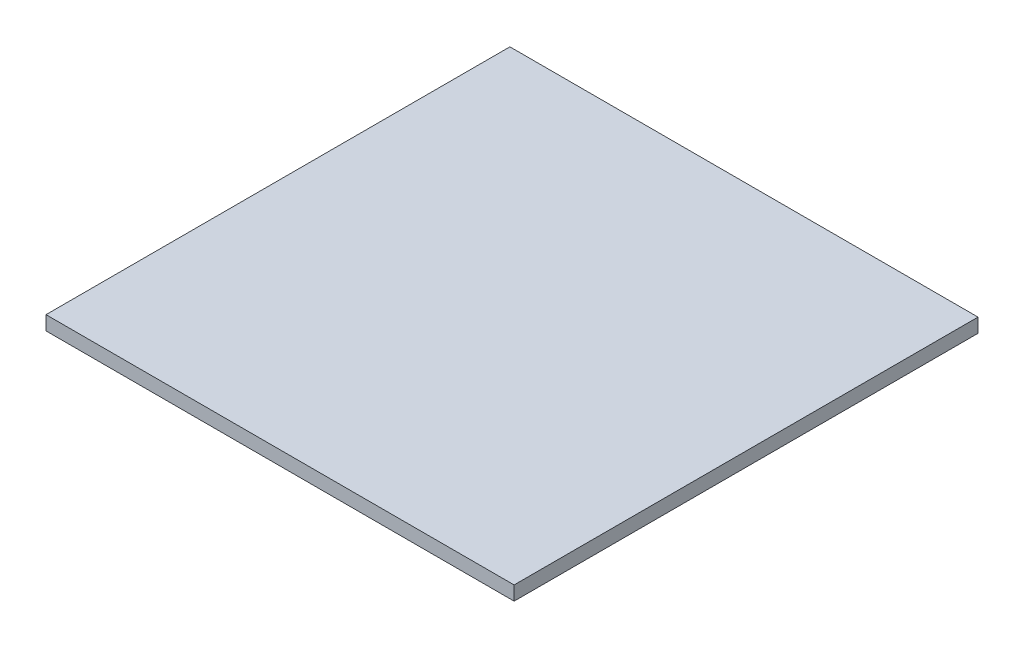
ISO-10303-21;
HEADER;
FILE_DESCRIPTION(('STEP AP214'),'2;1');
FILE_NAME('part.step','',(''),(''),'','','');
FILE_SCHEMA(('AUTOMOTIVE_DESIGN { 1 0 10303 214 1 1 1 1 }'));
ENDSEC;
DATA;
#1=APPLICATION_CONTEXT('core data for automotive mechanical design processes');
#2=APPLICATION_PROTOCOL_DEFINITION('international standard','automotive_design',2000,#1);
#3=PRODUCT_CONTEXT('',#1,'mechanical');
#4=PRODUCT('Part','Part','',(#3));
#5=PRODUCT_RELATED_PRODUCT_CATEGORY('part','',(#4));
#6=PRODUCT_DEFINITION_FORMATION('','',#4);
#7=PRODUCT_DEFINITION_CONTEXT('part definition',#1,'design');
#8=PRODUCT_DEFINITION('design','',#6,#7);
#9=PRODUCT_DEFINITION_SHAPE('','',#8);
#10=(LENGTH_UNIT() NAMED_UNIT(*) SI_UNIT(.MILLI.,.METRE.));
#11=(NAMED_UNIT(*) PLANE_ANGLE_UNIT() SI_UNIT($,.RADIAN.));
#12=(NAMED_UNIT(*) SI_UNIT($,.STERADIAN.) SOLID_ANGLE_UNIT());
#13=UNCERTAINTY_MEASURE_WITH_UNIT(LENGTH_MEASURE(1.E-05),#10,'distance_accuracy_value','');
#14=(GEOMETRIC_REPRESENTATION_CONTEXT(3) GLOBAL_UNCERTAINTY_ASSIGNED_CONTEXT((#13)) GLOBAL_UNIT_ASSIGNED_CONTEXT((#10,
#11,#12)) REPRESENTATION_CONTEXT('',''));
#15=CARTESIAN_POINT('',(0.,0.,0.));
#16=DIRECTION('',(0.,0.,1.));
#17=DIRECTION('',(1.,0.,0.));
#18=AXIS2_PLACEMENT_3D('',#15,#16,#17);
#19=CARTESIAN_POINT('',(-44.2815420560747,3.,-20.6980140186916));
#20=DIRECTION('',(1.,0.,0.));
#21=DIRECTION('',(0.,0.,-1.));
#22=AXIS2_PLACEMENT_3D('',#19,#20,#21);
#23=PLANE('',#22);
#24=DIRECTION('',(0.,0.,1.));
#25=VECTOR('',#24,1.);
#26=CARTESIAN_POINT('',(-44.2815420560747,0.,-20.6980140186916));
#27=LINE('',#26,#25);
#28=CARTESIAN_POINT('',(-44.2815420560747,0.,-20.6980140186916));
#29=VERTEX_POINT('',#28);
#30=CARTESIAN_POINT('',(-44.2815420560747,0.,78.1019859813084));
#31=VERTEX_POINT('',#30);
#32=EDGE_CURVE('E96',#29,#31,#27,.T.);
#33=ORIENTED_EDGE('',*,*,#32,.T.);
#34=DIRECTION('',(0.,-1.,0.));
#35=VECTOR('',#34,1.);
#36=CARTESIAN_POINT('',(-44.2815420560747,3.,78.1019859813084));
#37=LINE('',#36,#35);
#38=CARTESIAN_POINT('',(-44.2815420560747,3.,78.1019859813084));
#39=VERTEX_POINT('',#38);
#40=EDGE_CURVE('E11',#39,#31,#37,.T.);
#41=ORIENTED_EDGE('',*,*,#40,.F.);
#42=DIRECTION('',(0.,0.,1.));
#43=VECTOR('',#42,1.);
#44=CARTESIAN_POINT('',(-44.2815420560747,3.,-20.6980140186916));
#45=LINE('',#44,#43);
#46=CARTESIAN_POINT('',(-44.2815420560747,3.,-20.6980140186916));
#47=VERTEX_POINT('',#46);
#48=EDGE_CURVE('E84',#47,#39,#45,.T.);
#49=ORIENTED_EDGE('',*,*,#48,.F.);
#50=DIRECTION('',(0.,-1.,0.));
#51=VECTOR('',#50,1.);
#52=CARTESIAN_POINT('',(-44.2815420560747,3.,-20.6980140186916));
#53=LINE('',#52,#51);
#54=EDGE_CURVE('E92',#47,#29,#53,.T.);
#55=ORIENTED_EDGE('',*,*,#54,.T.);
#56=EDGE_LOOP('',(#33,#41,#49,#55));
#57=FACE_BOUND('',#56,.T.);
#58=ADVANCED_FACE('F33',(#57),#23,.F.);
#59=CARTESIAN_POINT('',(-44.2815420560747,3.,78.1019859813084));
#60=DIRECTION('',(0.,0.,-1.));
#61=DIRECTION('',(-1.,0.,0.));
#62=AXIS2_PLACEMENT_3D('',#59,#60,#61);
#63=PLANE('',#62);
#64=DIRECTION('',(1.,0.,0.));
#65=VECTOR('',#64,1.);
#66=CARTESIAN_POINT('',(-44.2815420560747,0.,78.1019859813084));
#67=LINE('',#66,#65);
#68=CARTESIAN_POINT('',(55.4184579439253,0.,78.1019859813084));
#69=VERTEX_POINT('',#68);
#70=EDGE_CURVE('E88',#31,#69,#67,.T.);
#71=ORIENTED_EDGE('',*,*,#70,.T.);
#72=DIRECTION('',(0.,-1.,0.));
#73=VECTOR('',#72,1.);
#74=CARTESIAN_POINT('',(55.4184579439253,3.,78.1019859813084));
#75=LINE('',#74,#73);
#76=CARTESIAN_POINT('',(55.4184579439253,3.,78.1019859813084));
#77=VERTEX_POINT('',#76);
#78=EDGE_CURVE('E41',#77,#69,#75,.T.);
#79=ORIENTED_EDGE('',*,*,#78,.F.);
#80=DIRECTION('',(1.,0.,0.));
#81=VECTOR('',#80,1.);
#82=CARTESIAN_POINT('',(-44.2815420560747,3.,78.1019859813084));
#83=LINE('',#82,#81);
#84=EDGE_CURVE('E79',#39,#77,#83,.T.);
#85=ORIENTED_EDGE('',*,*,#84,.F.);
#86=ORIENTED_EDGE('',*,*,#40,.T.);
#87=EDGE_LOOP('',(#71,#79,#85,#86));
#88=FACE_BOUND('',#87,.T.);
#89=ADVANCED_FACE('F87',(#88),#63,.F.);
#90=CARTESIAN_POINT('',(55.4184579439252,3.,-20.6980140186916));
#91=DIRECTION('',(-1.,0.,0.));
#92=DIRECTION('',(0.,0.,1.));
#93=AXIS2_PLACEMENT_3D('',#90,#91,#92);
#94=PLANE('',#93);
#95=DIRECTION('',(0.,0.,-1.));
#96=VECTOR('',#95,1.);
#97=CARTESIAN_POINT('',(55.4184579439252,0.,-20.6980140186916));
#98=LINE('',#97,#96);
#99=CARTESIAN_POINT('',(55.4184579439252,0.,-20.6980140186916));
#100=VERTEX_POINT('',#99);
#101=EDGE_CURVE('E66',#69,#100,#98,.T.);
#102=ORIENTED_EDGE('',*,*,#101,.T.);
#103=DIRECTION('',(0.,-1.,0.));
#104=VECTOR('',#103,1.);
#105=CARTESIAN_POINT('',(55.4184579439252,3.,-20.6980140186916));
#106=LINE('',#105,#104);
#107=CARTESIAN_POINT('',(55.4184579439252,3.,-20.6980140186916));
#108=VERTEX_POINT('',#107);
#109=EDGE_CURVE('E89',#108,#100,#106,.T.);
#110=ORIENTED_EDGE('',*,*,#109,.F.);
#111=DIRECTION('',(0.,0.,-1.));
#112=VECTOR('',#111,1.);
#113=CARTESIAN_POINT('',(55.4184579439252,3.,-20.6980140186916));
#114=LINE('',#113,#112);
#115=EDGE_CURVE('E82',#77,#108,#114,.T.);
#116=ORIENTED_EDGE('',*,*,#115,.F.);
#117=ORIENTED_EDGE('',*,*,#78,.T.);
#118=EDGE_LOOP('',(#102,#110,#116,#117));
#119=FACE_BOUND('',#118,.T.);
#120=ADVANCED_FACE('F90',(#119),#94,.F.);
#121=CARTESIAN_POINT('',(-44.2815420560747,3.,-20.6980140186916));
#122=DIRECTION('',(0.,0.,1.));
#123=DIRECTION('',(1.,0.,0.));
#124=AXIS2_PLACEMENT_3D('',#121,#122,#123);
#125=PLANE('',#124);
#126=DIRECTION('',(-1.,0.,0.));
#127=VECTOR('',#126,1.);
#128=CARTESIAN_POINT('',(-44.2815420560747,0.,-20.6980140186916));
#129=LINE('',#128,#127);
#130=EDGE_CURVE('E72',#100,#29,#129,.T.);
#131=ORIENTED_EDGE('',*,*,#130,.T.);
#132=ORIENTED_EDGE('',*,*,#54,.F.);
#133=DIRECTION('',(-1.,0.,0.));
#134=VECTOR('',#133,1.);
#135=CARTESIAN_POINT('',(-44.2815420560747,3.,-20.6980140186916));
#136=LINE('',#135,#134);
#137=EDGE_CURVE('E49',#108,#47,#136,.T.);
#138=ORIENTED_EDGE('',*,*,#137,.F.);
#139=ORIENTED_EDGE('',*,*,#109,.T.);
#140=EDGE_LOOP('',(#131,#132,#138,#139));
#141=FACE_BOUND('',#140,.T.);
#142=ADVANCED_FACE('F103',(#141),#125,.F.);
#143=CARTESIAN_POINT('',(0.,3.,0.));
#144=DIRECTION('',(0.,1.,0.));
#145=DIRECTION('',(0.,0.,1.));
#146=AXIS2_PLACEMENT_3D('',#143,#144,#145);
#147=PLANE('',#146);
#148=ORIENTED_EDGE('',*,*,#48,.T.);
#149=ORIENTED_EDGE('',*,*,#84,.T.);
#150=ORIENTED_EDGE('',*,*,#115,.T.);
#151=ORIENTED_EDGE('',*,*,#137,.T.);
#152=EDGE_LOOP('',(#148,#149,#150,#151));
#153=FACE_BOUND('',#152,.T.);
#154=ADVANCED_FACE('F80',(#153),#147,.T.);
#155=CARTESIAN_POINT('',(0.,0.,0.));
#156=DIRECTION('',(0.,1.,0.));
#157=DIRECTION('',(0.,0.,1.));
#158=AXIS2_PLACEMENT_3D('',#155,#156,#157);
#159=PLANE('',#158);
#160=ORIENTED_EDGE('',*,*,#32,.F.);
#161=ORIENTED_EDGE('',*,*,#130,.F.);
#162=ORIENTED_EDGE('',*,*,#101,.F.);
#163=ORIENTED_EDGE('',*,*,#70,.F.);
#164=EDGE_LOOP('',(#160,#161,#162,#163));
#165=FACE_BOUND('',#164,.T.);
#166=ADVANCED_FACE('F106',(#165),#159,.F.);
#167=CLOSED_SHELL('',(#58,#89,#120,#142,#154,#166));
#168=MANIFOLD_SOLID_BREP('B2',#167);
#169=ADVANCED_BREP_SHAPE_REPRESENTATION('',(#18,#168),#14);
#170=SHAPE_DEFINITION_REPRESENTATION(#9,#169);
ENDSEC;
END-ISO-10303-21;
